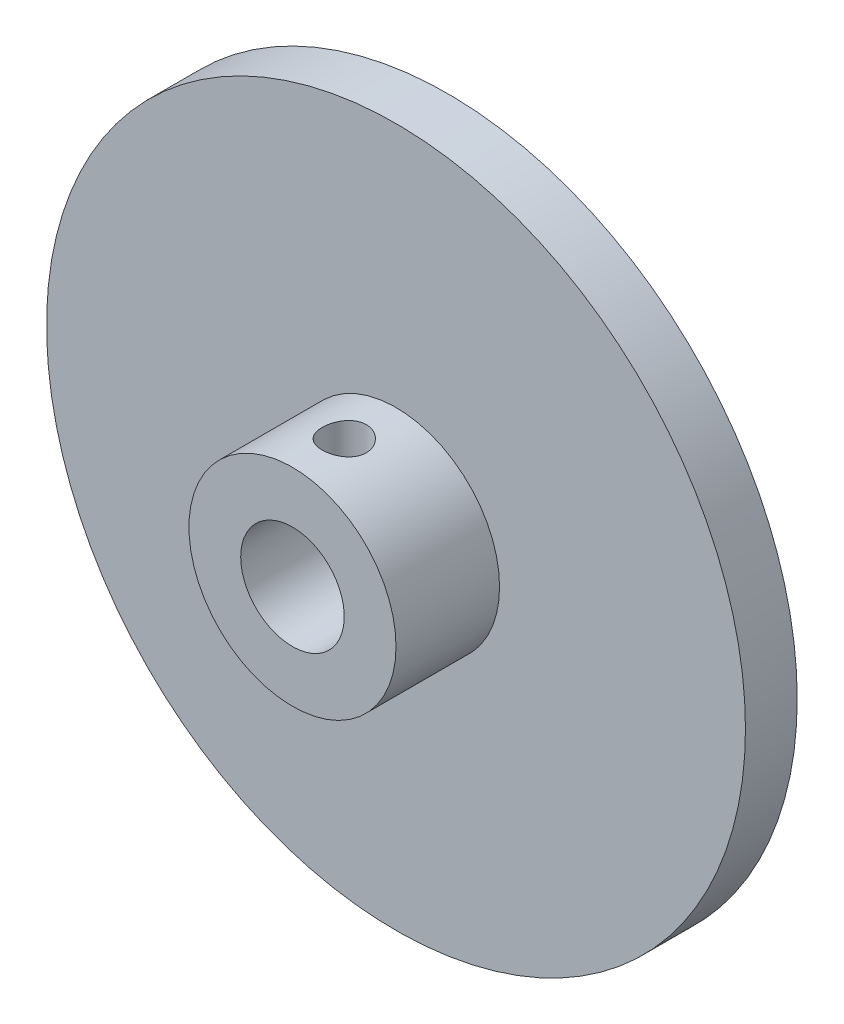
ISO-10303-21;
HEADER;
FILE_DESCRIPTION(('STEP AP214'),'2;1');
FILE_NAME('part.step','',(''),(''),'','','');
FILE_SCHEMA(('AUTOMOTIVE_DESIGN { 1 0 10303 214 1 1 1 1 }'));
ENDSEC;
DATA;
#1=APPLICATION_CONTEXT('core data for automotive mechanical design processes');
#2=APPLICATION_PROTOCOL_DEFINITION('international standard','automotive_design',2000,#1);
#3=PRODUCT_CONTEXT('',#1,'mechanical');
#4=PRODUCT('Part','Part','',(#3));
#5=PRODUCT_RELATED_PRODUCT_CATEGORY('part','',(#4));
#6=PRODUCT_DEFINITION_FORMATION('','',#4);
#7=PRODUCT_DEFINITION_CONTEXT('part definition',#1,'design');
#8=PRODUCT_DEFINITION('design','',#6,#7);
#9=PRODUCT_DEFINITION_SHAPE('','',#8);
#10=(LENGTH_UNIT() NAMED_UNIT(*) SI_UNIT(.MILLI.,.METRE.));
#11=(NAMED_UNIT(*) PLANE_ANGLE_UNIT() SI_UNIT($,.RADIAN.));
#12=(NAMED_UNIT(*) SI_UNIT($,.STERADIAN.) SOLID_ANGLE_UNIT());
#13=UNCERTAINTY_MEASURE_WITH_UNIT(LENGTH_MEASURE(1.E-05),#10,'distance_accuracy_value','');
#14=(GEOMETRIC_REPRESENTATION_CONTEXT(3) GLOBAL_UNCERTAINTY_ASSIGNED_CONTEXT((#13)) GLOBAL_UNIT_ASSIGNED_CONTEXT((#10,
#11,#12)) REPRESENTATION_CONTEXT('',''));
#15=CARTESIAN_POINT('',(0.,0.,0.));
#16=DIRECTION('',(0.,0.,1.));
#17=DIRECTION('',(1.,0.,0.));
#18=AXIS2_PLACEMENT_3D('',#15,#16,#17);
#19=CARTESIAN_POINT('',(0.,0.,3.175));
#20=DIRECTION('',(0.,0.,-1.));
#21=DIRECTION('',(-1.,0.,0.));
#22=AXIS2_PLACEMENT_3D('',#19,#20,#21);
#23=CYLINDRICAL_SURFACE('',#22,21.43125);
#24=CARTESIAN_POINT('',(0.,0.,3.175));
#25=DIRECTION('',(0.,0.,1.));
#26=DIRECTION('',(1.,0.,0.));
#27=AXIS2_PLACEMENT_3D('',#24,#25,#26);
#28=CIRCLE('',#27,21.43125);
#29=CARTESIAN_POINT('',(21.43125,0.,3.175));
#30=VERTEX_POINT('',#29);
#31=EDGE_CURVE('E41',#30,#30,#28,.T.);
#32=ORIENTED_EDGE('',*,*,#31,.F.);
#33=EDGE_LOOP('',(#32));
#34=FACE_BOUND('',#33,.T.);
#35=CARTESIAN_POINT('',(0.,0.,0.));
#36=DIRECTION('',(0.,0.,1.));
#37=DIRECTION('',(1.,0.,0.));
#38=AXIS2_PLACEMENT_3D('',#35,#36,#37);
#39=CIRCLE('',#38,21.43125);
#40=CARTESIAN_POINT('',(21.43125,0.,0.));
#41=VERTEX_POINT('',#40);
#42=EDGE_CURVE('E37',#41,#41,#39,.T.);
#43=ORIENTED_EDGE('',*,*,#42,.T.);
#44=EDGE_LOOP('',(#43));
#45=FACE_BOUND('',#44,.T.);
#46=ADVANCED_FACE('F34',(#34,#45),#23,.T.);
#47=CARTESIAN_POINT('',(0.,0.,3.175));
#48=DIRECTION('',(0.,0.,1.));
#49=DIRECTION('',(1.,0.,0.));
#50=AXIS2_PLACEMENT_3D('',#47,#48,#49);
#51=PLANE('',#50);
#52=CARTESIAN_POINT('',(0.,0.,3.175));
#53=DIRECTION('',(0.,0.,1.));
#54=DIRECTION('',(1.,0.,0.));
#55=AXIS2_PLACEMENT_3D('',#52,#53,#54);
#56=CIRCLE('',#55,6.35);
#57=CARTESIAN_POINT('',(6.35,0.,3.175));
#58=VERTEX_POINT('',#57);
#59=EDGE_CURVE('E10',#58,#58,#56,.T.);
#60=ORIENTED_EDGE('',*,*,#59,.F.);
#61=EDGE_LOOP('',(#60));
#62=FACE_BOUND('',#61,.T.);
#63=ORIENTED_EDGE('',*,*,#31,.T.);
#64=EDGE_LOOP('',(#63));
#65=FACE_BOUND('',#64,.T.);
#66=ADVANCED_FACE('F93',(#62,#65),#51,.T.);
#67=CARTESIAN_POINT('',(0.,0.,0.));
#68=DIRECTION('',(0.,0.,1.));
#69=DIRECTION('',(1.,0.,0.));
#70=AXIS2_PLACEMENT_3D('',#67,#68,#69);
#71=PLANE('',#70);
#72=CARTESIAN_POINT('',(0.,0.,0.));
#73=DIRECTION('',(0.,0.,-1.));
#74=DIRECTION('',(-1.,0.,0.));
#75=AXIS2_PLACEMENT_3D('',#72,#73,#74);
#76=CIRCLE('',#75,3.175);
#77=CARTESIAN_POINT('',(-3.175,0.,0.));
#78=VERTEX_POINT('',#77);
#79=EDGE_CURVE('E51',#78,#78,#76,.T.);
#80=ORIENTED_EDGE('',*,*,#79,.F.);
#81=EDGE_LOOP('',(#80));
#82=FACE_BOUND('',#81,.T.);
#83=ORIENTED_EDGE('',*,*,#42,.F.);
#84=EDGE_LOOP('',(#83));
#85=FACE_BOUND('',#84,.T.);
#86=ADVANCED_FACE('F89',(#82,#85),#71,.F.);
#87=CARTESIAN_POINT('',(0.,0.,9.525));
#88=DIRECTION('',(0.,0.,-1.));
#89=DIRECTION('',(-1.,0.,0.));
#90=AXIS2_PLACEMENT_3D('',#87,#88,#89);
#91=CYLINDRICAL_SURFACE('',#90,6.35);
#92=CARTESIAN_POINT('',(0.,6.35,7.70255));
#93=CARTESIAN_POINT('',(-0.0750646140818434,6.34999861096237,7.70254737073417));
#94=CARTESIAN_POINT('',(-0.150161450028055,6.34865540088408,7.69627992657758));
#95=CARTESIAN_POINT('',(-0.298225296339674,6.34342675076644,7.67139984164008));
#96=CARTESIAN_POINT('',(-0.371190689529798,6.33953943023363,7.65277806894851));
#97=CARTESIAN_POINT('',(-0.512830125656908,6.32965577699744,7.603796439198));
#98=CARTESIAN_POINT('',(-0.581508452531715,6.32366159067733,7.57344852510907));
#99=CARTESIAN_POINT('',(-0.712795420037444,6.31021261659612,7.5019132358319));
#100=CARTESIAN_POINT('',(-0.775404281331161,6.30275788196482,7.46072625491349));
#101=CARTESIAN_POINT('',(-0.893733729529973,6.28707845908267,7.36801641240627));
#102=CARTESIAN_POINT('',(-0.949348399501573,6.27884463503177,7.31635989745548));
#103=CARTESIAN_POINT('',(-1.05119276861777,6.26260005999281,7.20446437873646));
#104=CARTESIAN_POINT('',(-1.09742166485733,6.25458932813968,7.14422464146688));
#105=CARTESIAN_POINT('',(-1.17964434517394,6.23960815322762,7.01609621196687));
#106=CARTESIAN_POINT('',(-1.21552634219633,6.23264943245589,6.94813429098301));
#107=CARTESIAN_POINT('',(-1.27531989778063,6.22069088315544,6.80697282167514));
#108=CARTESIAN_POINT('',(-1.29923280847738,6.21569083337163,6.73377386604163));
#109=CARTESIAN_POINT('',(-1.33406128746238,6.20830861045501,6.58536223184559));
#110=CARTESIAN_POINT('',(-1.34516385912344,6.20588881195717,6.51019534927045));
#111=CARTESIAN_POINT('',(-1.35463777151121,6.20382799290792,6.35902984251258));
#112=CARTESIAN_POINT('',(-1.35301059361624,6.20418664902391,6.28303131613722));
#113=CARTESIAN_POINT('',(-1.33722190727113,6.20760811333917,6.13374306124383));
#114=CARTESIAN_POINT('',(-1.32327672735781,6.2106242486392,6.06042922291285));
#115=CARTESIAN_POINT('',(-1.28359022137343,6.21894713261562,5.91720610345467));
#116=CARTESIAN_POINT('',(-1.25784826428298,6.22425400382448,5.84729700467113));
#117=CARTESIAN_POINT('',(-1.19509780651165,6.23660694361686,5.71225487729554));
#118=CARTESIAN_POINT('',(-1.15800532064544,6.24366590013669,5.64716210229017));
#119=CARTESIAN_POINT('',(-1.07366584098501,6.25871962533893,5.52404430904634));
#120=CARTESIAN_POINT('',(-1.02641753096658,6.2667145152598,5.46602020845719));
#121=CARTESIAN_POINT('',(-0.921958343447951,6.2829401548711,5.35744048769627));
#122=CARTESIAN_POINT('',(-0.864563295807785,6.29117238219288,5.30706210282791));
#123=CARTESIAN_POINT('',(-0.742047254963458,6.30679580872777,5.21661794179964));
#124=CARTESIAN_POINT('',(-0.676926135506121,6.31418699419339,5.17655233419665));
#125=CARTESIAN_POINT('',(-0.5405963046733,6.32731762757995,5.10783073935462));
#126=CARTESIAN_POINT('',(-0.46937602644303,6.3330538427319,5.07919704156644));
#127=CARTESIAN_POINT('',(-0.322985870928896,6.34220404917476,5.03435198574641));
#128=CARTESIAN_POINT('',(-0.247816539193656,6.34561836032498,5.01813891664289));
#129=CARTESIAN_POINT('',(-0.0971831975907131,6.34969483950221,4.99885097050666));
#130=CARTESIAN_POINT('',(-0.0217515388494182,6.35040774522148,4.99553385095834));
#131=CARTESIAN_POINT('',(0.128588082469587,6.34914287490065,5.00147669974056));
#132=CARTESIAN_POINT('',(0.203496078330147,6.34716527145521,5.01073586130961));
#133=CARTESIAN_POINT('',(0.349866034457529,6.34077352324427,5.04136743385906));
#134=CARTESIAN_POINT('',(0.421355609891958,6.33638477329703,5.06261365582203));
#135=CARTESIAN_POINT('',(0.559756726901239,6.32566160887462,5.11647686686692));
#136=CARTESIAN_POINT('',(0.626667892088093,6.319327034669,5.14909478946832));
#137=CARTESIAN_POINT('',(0.755020804805226,6.30528928586048,5.22528628571363));
#138=CARTESIAN_POINT('',(0.816375459390217,6.29756861532476,5.2690032828613));
#139=CARTESIAN_POINT('',(0.930964829041667,6.28165242253472,5.3659621104687));
#140=CARTESIAN_POINT('',(0.984198546279221,6.2734568420981,5.4192051096557));
#141=CARTESIAN_POINT('',(1.08198553722146,6.2573405892671,5.53481349998988));
#142=CARTESIAN_POINT('',(1.1263715051453,6.2494271894923,5.59732160373991));
#143=CARTESIAN_POINT('',(1.20401575994887,6.23493483661359,5.72904773091925));
#144=CARTESIAN_POINT('',(1.23727451894147,6.22835582689793,5.79826546950682));
#145=CARTESIAN_POINT('',(1.29150180342355,6.21733781696005,5.94108031915002));
#146=CARTESIAN_POINT('',(1.31253798284658,6.21288706126121,6.01465079056797));
#147=CARTESIAN_POINT('',(1.34192355845653,6.2066070485769,6.16438861944233));
#148=CARTESIAN_POINT('',(1.35027486356241,6.20477739714954,6.24055558439385));
#149=CARTESIAN_POINT('',(1.3539756757237,6.20397068907972,6.39163973219357));
#150=CARTESIAN_POINT('',(1.34959015346798,6.20493549674238,6.46655023703136));
#151=CARTESIAN_POINT('',(1.32853178134124,6.20947801810159,6.61453887630111));
#152=CARTESIAN_POINT('',(1.31185906106091,6.21305570424062,6.68761703005012));
#153=CARTESIAN_POINT('',(1.26682455867663,6.22239325528924,6.82966923948335));
#154=CARTESIAN_POINT('',(1.23849943440763,6.22814627217719,6.89865539651983));
#155=CARTESIAN_POINT('',(1.17099639387991,6.24118930990987,7.03093635025732));
#156=CARTESIAN_POINT('',(1.13181741499343,6.24847948123033,7.09423058889684));
#157=CARTESIAN_POINT('',(1.04283172893201,6.26395040356261,7.21464141782745));
#158=CARTESIAN_POINT('',(0.99283538063987,6.27214556837561,7.27161603459636));
#159=CARTESIAN_POINT('',(0.884020822113279,6.2884042122436,7.37645398581748));
#160=CARTESIAN_POINT('',(0.825200580420686,6.29646766049922,7.42431521639077));
#161=CARTESIAN_POINT('',(0.699546337421048,6.31167047796941,7.51012290218367));
#162=CARTESIAN_POINT('',(0.632623562218123,6.31879741398043,7.54794167619793));
#163=CARTESIAN_POINT('',(0.493235348200114,6.33120028356375,7.61173467200623));
#164=CARTESIAN_POINT('',(0.420774730811316,6.33647780542986,7.63771906305292));
#165=CARTESIAN_POINT('',(0.2901768273112,6.34361905124058,7.67234743478013));
#166=CARTESIAN_POINT('',(0.232758269670467,6.34599734619059,7.68365224038747));
#167=CARTESIAN_POINT('',(0.11689962831609,6.34918833005957,7.69875439627315));
#168=CARTESIAN_POINT('',(0.058459585666748,6.35000108176889,7.70255204764645));
#169=CARTESIAN_POINT('',(0.,6.35,7.70255));
#170=B_SPLINE_CURVE_WITH_KNOTS('',3,(#92,#93,#94,#95,#96,#97,#98,#99,#100,#101,#102,#103,#104,
#105,#106,#107,#108,#109,#110,#111,#112,#113,#114,#115,#116,#117,#118,#119,#120,#121,#122,#123,
#124,#125,#126,#127,#128,#129,#130,#131,#132,#133,#134,#135,#136,#137,#138,#139,#140,#141,#142,
#143,#144,#145,#146,#147,#148,#149,#150,#151,#152,#153,#154,#155,#156,#157,#158,#159,#160,#161,
#162,#163,#164,#165,#166,#167,#168,#169),.UNSPECIFIED.,.T.,.F.,(4,2,2,2,2,2,2,2,2,2,2,2,2,2,2,2,
2,2,2,2,2,2,2,2,2,2,2,2,2,2,2,2,2,2,2,2,2,2,4),(0.,0.224979895980791,0.450126275209806,
0.67504394674997,0.899953438065849,1.12793886928433,1.355943795283,1.58632693132888,
1.81668403536191,2.04363409247309,2.27055773948938,2.49357367370591,2.71660153862233,
2.94132126356156,3.16607013040717,3.39542056996827,3.6247747579039,3.85457397221981,
4.08434152359174,4.3097715649296,4.53518714573762,4.75827288077635,4.98137693356217,
5.20752538847284,5.43370160816211,5.66381649384172,5.89392161481026,6.12274062574888,
6.35152519880279,6.57558456164185,6.79964156140387,7.02299901575426,7.24637834526044,
7.47404733340156,7.70176881671732,7.93226022587938,8.16255319898055,8.33777236451397,
8.51298450226033),.UNSPECIFIED.);
#171=CARTESIAN_POINT('',(0.,6.35,7.70255));
#172=VERTEX_POINT('',#171);
#173=EDGE_CURVE('E54',#172,#172,#170,.T.);
#174=ORIENTED_EDGE('',*,*,#173,.T.);
#175=EDGE_LOOP('',(#174));
#176=FACE_BOUND('',#175,.T.);
#177=CARTESIAN_POINT('',(0.,0.,9.525));
#178=DIRECTION('',(0.,0.,1.));
#179=DIRECTION('',(1.,0.,0.));
#180=AXIS2_PLACEMENT_3D('',#177,#178,#179);
#181=CIRCLE('',#180,6.35);
#182=CARTESIAN_POINT('',(6.35,0.,9.525));
#183=VERTEX_POINT('',#182);
#184=EDGE_CURVE('E47',#183,#183,#181,.T.);
#185=ORIENTED_EDGE('',*,*,#184,.F.);
#186=EDGE_LOOP('',(#185));
#187=FACE_BOUND('',#186,.T.);
#188=ORIENTED_EDGE('',*,*,#59,.T.);
#189=EDGE_LOOP('',(#188));
#190=FACE_BOUND('',#189,.T.);
#191=ADVANCED_FACE('F69',(#176,#187,#190),#91,.T.);
#192=CARTESIAN_POINT('',(0.,0.,9.525));
#193=DIRECTION('',(0.,0.,1.));
#194=DIRECTION('',(1.,0.,0.));
#195=AXIS2_PLACEMENT_3D('',#192,#193,#194);
#196=PLANE('',#195);
#197=CARTESIAN_POINT('',(0.,0.,9.525));
#198=DIRECTION('',(0.,0.,-1.));
#199=DIRECTION('',(-1.,0.,0.));
#200=AXIS2_PLACEMENT_3D('',#197,#198,#199);
#201=CIRCLE('',#200,3.175);
#202=CARTESIAN_POINT('',(-3.175,0.,9.525));
#203=VERTEX_POINT('',#202);
#204=EDGE_CURVE('E50',#203,#203,#201,.T.);
#205=ORIENTED_EDGE('',*,*,#204,.T.);
#206=EDGE_LOOP('',(#205));
#207=FACE_BOUND('',#206,.T.);
#208=ORIENTED_EDGE('',*,*,#184,.T.);
#209=EDGE_LOOP('',(#208));
#210=FACE_BOUND('',#209,.T.);
#211=ADVANCED_FACE('F82',(#207,#210),#196,.T.);
#212=CARTESIAN_POINT('',(0.,0.,9.525));
#213=DIRECTION('',(0.,0.,-1.));
#214=DIRECTION('',(-1.,0.,0.));
#215=AXIS2_PLACEMENT_3D('',#212,#213,#214);
#216=CYLINDRICAL_SURFACE('',#215,3.175);
#217=CARTESIAN_POINT('',(0.,3.175,7.70255));
#218=CARTESIAN_POINT('',(0.0723119803182968,3.1749937642741,7.70254177520317));
#219=CARTESIAN_POINT('',(0.144730355969441,3.17250122265995,7.69671677085276));
#220=CARTESIAN_POINT('',(0.287508253069319,3.16277066799621,7.67362700946327));
#221=CARTESIAN_POINT('',(0.357862061157262,3.15552058505164,7.65633315473188));
#222=CARTESIAN_POINT('',(0.494208939922367,3.13705242394937,7.61106652134826));
#223=CARTESIAN_POINT('',(0.560216141686439,3.12584804282756,7.58313057893921));
#224=CARTESIAN_POINT('',(0.686540807637017,3.1005551810215,7.51752831329107));
#225=CARTESIAN_POINT('',(0.746859846370329,3.0864675019097,7.47986469363826));
#226=CARTESIAN_POINT('',(0.863330621553544,3.05599084668588,7.3938105223501));
#227=CARTESIAN_POINT('',(0.919148042993753,3.03952431771544,7.34499522263455));
#228=CARTESIAN_POINT('',(1.02209379973983,3.00647271455961,7.23892253623825));
#229=CARTESIAN_POINT('',(1.06921736595388,2.98988758046311,7.18166054685898));
#230=CARTESIAN_POINT('',(1.15586188650404,2.95750917471473,7.05671614571851));
#231=CARTESIAN_POINT('',(1.19486044876668,2.94180185247632,6.98864683913289));
#232=CARTESIAN_POINT('',(1.26070499788386,2.91419493098839,6.84615021576441));
#233=CARTESIAN_POINT('',(1.2875575237776,2.90229328389849,6.77172634579415));
#234=CARTESIAN_POINT('',(1.32695137173236,2.88448854081883,6.62248178209826));
#235=CARTESIAN_POINT('',(1.34013766580825,2.87831670118836,6.54786466649272));
#236=CARTESIAN_POINT('',(1.35383505668087,2.87190163928982,6.39724141107698));
#237=CARTESIAN_POINT('',(1.35435360727363,2.87165493063134,6.32123611443425));
#238=CARTESIAN_POINT('',(1.34318495882507,2.87689162283199,6.17655646216194));
#239=CARTESIAN_POINT('',(1.3324808719224,2.88191351336426,6.10778608927004));
#240=CARTESIAN_POINT('',(1.30082548820465,2.89633861211708,5.97313102087289));
#241=CARTESIAN_POINT('',(1.27987212223332,2.90574270501209,5.9072469109829));
#242=CARTESIAN_POINT('',(1.22790087368374,2.92808748949866,5.77853272243311));
#243=CARTESIAN_POINT('',(1.19667432188826,2.94110054344015,5.71580002824039));
#244=CARTESIAN_POINT('',(1.12519137808888,2.96918199373291,5.59621377419416));
#245=CARTESIAN_POINT('',(1.08493133768207,2.98425121955486,5.53936260333507));
#246=CARTESIAN_POINT('',(0.992333949928201,3.01637253593642,5.42784411343625));
#247=CARTESIAN_POINT('',(0.939241995039339,3.03348193205179,5.37381804789814));
#248=CARTESIAN_POINT('',(0.824589839165175,3.06663259637418,5.27521552840121));
#249=CARTESIAN_POINT('',(0.763027479068144,3.08267359069275,5.23064149115567));
#250=CARTESIAN_POINT('',(0.631157998604151,3.11238486879188,5.15120918261834));
#251=CARTESIAN_POINT('',(0.560670064560461,3.12598548270222,5.11662308137786));
#252=CARTESIAN_POINT('',(0.414148596926306,3.14874388156016,5.06002704250685));
#253=CARTESIAN_POINT('',(0.33811829944544,3.15790423558693,5.03800983135907));
#254=CARTESIAN_POINT('',(0.188019452335298,3.17026332558042,5.00854491934094));
#255=CARTESIAN_POINT('',(0.114148617869651,3.17381325962292,5.0002373446985));
#256=CARTESIAN_POINT('',(-0.0340114282148164,3.17568105366636,4.99584992680004));
#257=CARTESIAN_POINT('',(-0.108300505854283,3.17400050350427,4.99976636798234));
#258=CARTESIAN_POINT('',(-0.251086365945457,3.16582243599864,5.01911043997587));
#259=CARTESIAN_POINT('',(-0.319682718417007,3.15958185757468,5.03392433271249));
#260=CARTESIAN_POINT('',(-0.453335115246512,3.14319082038792,5.07377756726435));
#261=CARTESIAN_POINT('',(-0.518390716382747,3.13303987341454,5.09881818591264));
#262=CARTESIAN_POINT('',(-0.645410792119005,3.10940117061925,5.15922832667114));
#263=CARTESIAN_POINT('',(-0.707215459370455,3.09581917390959,5.19489577974538));
#264=CARTESIAN_POINT('',(-0.824184879794796,3.06675439613932,5.27522103608394));
#265=CARTESIAN_POINT('',(-0.879346794690439,3.05127080824472,5.31988266069994));
#266=CARTESIAN_POINT('',(-0.985790778724582,3.01863676563666,5.42081760274854));
#267=CARTESIAN_POINT('',(-1.0364772307765,3.00144808863402,5.47770827444718));
#268=CARTESIAN_POINT('',(-1.12776122684815,2.96835692538155,5.59944302368866));
#269=CARTESIAN_POINT('',(-1.16835608123138,2.95245478278206,5.66428921469234));
#270=CARTESIAN_POINT('',(-1.23885812859457,2.92358303045918,5.80165757409286));
#271=CARTESIAN_POINT('',(-1.26857052110254,2.91066826625578,5.87429211735658));
#272=CARTESIAN_POINT('',(-1.31507928002952,2.88995701757537,6.02425935932626));
#273=CARTESIAN_POINT('',(-1.3318869503345,2.88215605454428,6.10158788211573));
#274=CARTESIAN_POINT('',(-1.35096216089002,2.87326066425685,6.2521089835159));
#275=CARTESIAN_POINT('',(-1.35428166989026,2.87168133184628,6.32514007908179));
#276=CARTESIAN_POINT('',(-1.34912066967993,2.87410980516818,6.47068163722144));
#277=CARTESIAN_POINT('',(-1.34064217966592,2.87811665484049,6.54319218675054));
#278=CARTESIAN_POINT('',(-1.31302255224126,2.89081435572085,6.68182444023977));
#279=CARTESIAN_POINT('',(-1.29444551613291,2.89925667251005,6.74808352632024));
#280=CARTESIAN_POINT('',(-1.24772175082135,2.91966810669131,6.87655240125548));
#281=CARTESIAN_POINT('',(-1.21957230769734,2.93163822413924,6.93876103578051));
#282=CARTESIAN_POINT('',(-1.15251036671548,2.95866974170816,7.06154945594293));
#283=CARTESIAN_POINT('',(-1.1130417786036,2.97387612153679,7.12179297640017));
#284=CARTESIAN_POINT('',(-1.02522167499385,3.00528179589943,7.23513050272946));
#285=CARTESIAN_POINT('',(-0.976866860266105,3.0214814577203,7.28822184044812));
#286=CARTESIAN_POINT('',(-0.868199860048703,3.05455722211636,7.38999082551859));
#287=CARTESIAN_POINT('',(-0.807251096145339,3.07138832065964,7.43800664347723));
#288=CARTESIAN_POINT('',(-0.677547032947667,3.10257916482516,7.52317457940271));
#289=CARTESIAN_POINT('',(-0.608788212504221,3.11693778833812,7.56032177006529));
#290=CARTESIAN_POINT('',(-0.466349244720166,3.14138312017248,7.62194468564941));
#291=CARTESIAN_POINT('',(-0.392758601835345,3.15153079407947,7.64660247811649));
#292=CARTESIAN_POINT('',(-0.242078283854141,3.16665584269732,7.68295039769719));
#293=CARTESIAN_POINT('',(-0.165000257484026,3.17164926980853,7.69468079369904));
#294=CARTESIAN_POINT('',(-0.0584013278768104,3.17459936321147,7.70160755828299));
#295=CARTESIAN_POINT('',(-0.0292093438574408,3.17500251882829,7.70255332228377));
#296=CARTESIAN_POINT('',(0.,3.175,7.70255));
#297=B_SPLINE_CURVE_WITH_KNOTS('',3,(#217,#218,#219,#220,#221,#222,#223,#224,#225,#226,#227,
#228,#229,#230,#231,#232,#233,#234,#235,#236,#237,#238,#239,#240,#241,#242,#243,#244,#245,#246,
#247,#248,#249,#250,#251,#252,#253,#254,#255,#256,#257,#258,#259,#260,#261,#262,#263,#264,#265,
#266,#267,#268,#269,#270,#271,#272,#273,#274,#275,#276,#277,#278,#279,#280,#281,#282,#283,#284,
#285,#286,#287,#288,#289,#290,#291,#292,#293,#294,#295,#296),.UNSPECIFIED.,.T.,.F.,(4,2,2,2,2,2,
2,2,2,2,2,2,2,2,2,2,2,2,2,2,2,2,2,2,2,2,2,2,2,2,2,2,2,2,2,2,2,2,2,4),(0.,0.216850050638945,
0.434252388523417,0.650908954368241,0.867505370130753,1.09439609589244,1.32141091689532,
1.56022386511507,1.79890809057365,2.02572902648839,2.25241649603317,2.46078251280768,
2.66919061253204,2.88212426261053,3.0951440666222,3.32706321416167,3.55904158793933,
3.79684693152949,4.03451451918157,4.25661426582137,4.4786465105086,4.68904802527598,
4.89947581724865,5.11647002970509,5.33355663169255,5.56682347195775,5.80015241655905,
6.03747459229679,6.27458864785546,6.49280702774581,6.71098806472672,6.91807492424948,
7.12522054501714,7.34512352029504,7.56510830550804,7.80215736760165,8.03931373022261,
8.27290548905712,8.50576753373727,8.59336087119996),.UNSPECIFIED.);
#298=CARTESIAN_POINT('',(0.,3.175,7.70255));
#299=VERTEX_POINT('',#298);
#300=EDGE_CURVE('E64',#299,#299,#297,.T.);
#301=ORIENTED_EDGE('',*,*,#300,.T.);
#302=EDGE_LOOP('',(#301));
#303=FACE_BOUND('',#302,.T.);
#304=ORIENTED_EDGE('',*,*,#204,.F.);
#305=EDGE_LOOP('',(#304));
#306=FACE_BOUND('',#305,.T.);
#307=ORIENTED_EDGE('',*,*,#79,.T.);
#308=EDGE_LOOP('',(#307));
#309=FACE_BOUND('',#308,.T.);
#310=ADVANCED_FACE('F76',(#303,#306,#309),#216,.F.);
#311=CARTESIAN_POINT('',(0.,6.35,6.35));
#312=DIRECTION('',(0.,1.,0.));
#313=DIRECTION('',(0.,0.,1.));
#314=AXIS2_PLACEMENT_3D('',#311,#312,#313);
#315=CYLINDRICAL_SURFACE('',#314,1.35255);
#316=ORIENTED_EDGE('',*,*,#300,.F.);
#317=EDGE_LOOP('',(#316));
#318=FACE_BOUND('',#317,.T.);
#319=ORIENTED_EDGE('',*,*,#173,.F.);
#320=EDGE_LOOP('',(#319));
#321=FACE_BOUND('',#320,.T.);
#322=ADVANCED_FACE('F73',(#318,#321),#315,.F.);
#323=CLOSED_SHELL('',(#46,#66,#86,#191,#211,#310,#322));
#324=MANIFOLD_SOLID_BREP('B2',#323);
#325=ADVANCED_BREP_SHAPE_REPRESENTATION('',(#18,#324),#14);
#326=SHAPE_DEFINITION_REPRESENTATION(#9,#325);
ENDSEC;
END-ISO-10303-21;
